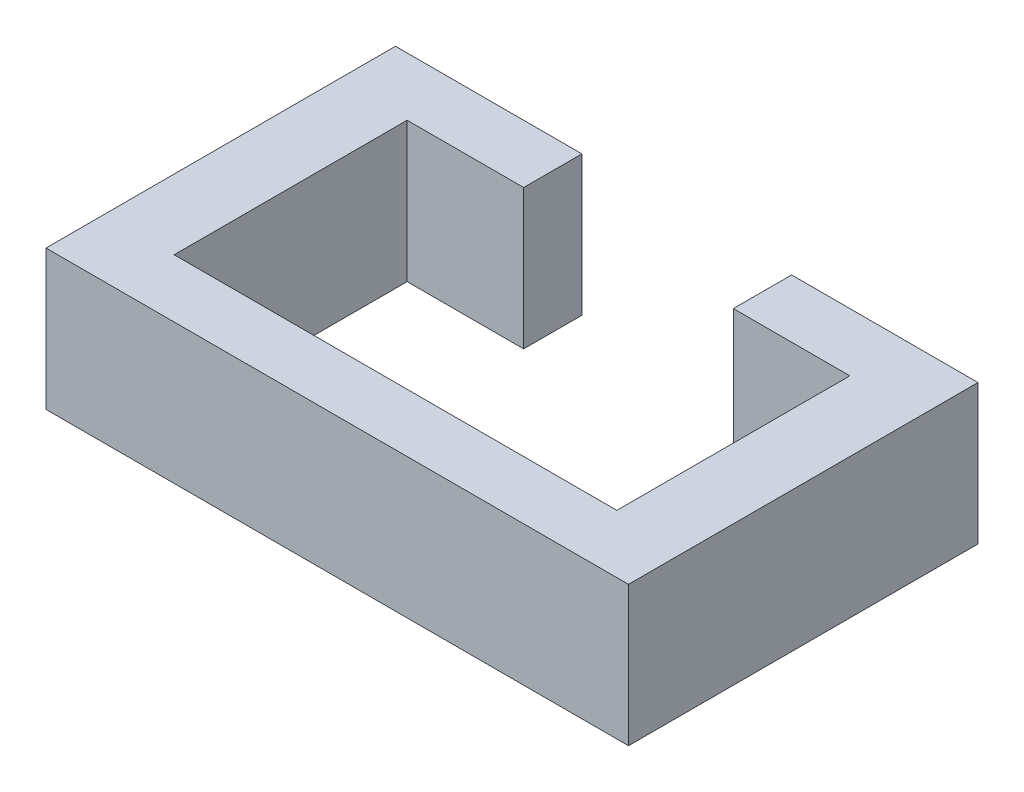
ISO-10303-21;
HEADER;
FILE_DESCRIPTION(('STEP AP214'),'2;1');
FILE_NAME('part.step','',(''),(''),'','','');
FILE_SCHEMA(('AUTOMOTIVE_DESIGN { 1 0 10303 214 1 1 1 1 }'));
ENDSEC;
DATA;
#1=APPLICATION_CONTEXT('core data for automotive mechanical design processes');
#2=APPLICATION_PROTOCOL_DEFINITION('international standard','automotive_design',2000,#1);
#3=PRODUCT_CONTEXT('',#1,'mechanical');
#4=PRODUCT('Part','Part','',(#3));
#5=PRODUCT_RELATED_PRODUCT_CATEGORY('part','',(#4));
#6=PRODUCT_DEFINITION_FORMATION('','',#4);
#7=PRODUCT_DEFINITION_CONTEXT('part definition',#1,'design');
#8=PRODUCT_DEFINITION('design','',#6,#7);
#9=PRODUCT_DEFINITION_SHAPE('','',#8);
#10=(LENGTH_UNIT() NAMED_UNIT(*) SI_UNIT(.MILLI.,.METRE.));
#11=(NAMED_UNIT(*) PLANE_ANGLE_UNIT() SI_UNIT($,.RADIAN.));
#12=(NAMED_UNIT(*) SI_UNIT($,.STERADIAN.) SOLID_ANGLE_UNIT());
#13=UNCERTAINTY_MEASURE_WITH_UNIT(LENGTH_MEASURE(1.E-05),#10,'distance_accuracy_value','');
#14=(GEOMETRIC_REPRESENTATION_CONTEXT(3) GLOBAL_UNCERTAINTY_ASSIGNED_CONTEXT((#13)) GLOBAL_UNIT_ASSIGNED_CONTEXT((#10,
#11,#12)) REPRESENTATION_CONTEXT('',''));
#15=CARTESIAN_POINT('',(0.,0.,0.));
#16=DIRECTION('',(0.,0.,1.));
#17=DIRECTION('',(1.,0.,0.));
#18=AXIS2_PLACEMENT_3D('',#15,#16,#17);
#19=CARTESIAN_POINT('',(-19.,12.,0.));
#20=DIRECTION('',(1.,0.,0.));
#21=DIRECTION('',(0.,0.,-1.));
#22=AXIS2_PLACEMENT_3D('',#19,#20,#21);
#23=PLANE('',#22);
#24=DIRECTION('',(0.,0.,1.));
#25=VECTOR('',#24,1.);
#26=CARTESIAN_POINT('',(-19.,0.,0.));
#27=LINE('',#26,#25);
#28=CARTESIAN_POINT('',(-19.,0.,-5.));
#29=VERTEX_POINT('',#28);
#30=CARTESIAN_POINT('',(-19.,0.,15.));
#31=VERTEX_POINT('',#30);
#32=EDGE_CURVE('E155',#29,#31,#27,.T.);
#33=ORIENTED_EDGE('',*,*,#32,.F.);
#34=DIRECTION('',(0.,-1.,0.));
#35=VECTOR('',#34,1.);
#36=CARTESIAN_POINT('',(-19.,12.,-5.));
#37=LINE('',#36,#35);
#38=CARTESIAN_POINT('',(-19.,12.,-5.));
#39=VERTEX_POINT('',#38);
#40=EDGE_CURVE('E11',#39,#29,#37,.T.);
#41=ORIENTED_EDGE('',*,*,#40,.F.);
#42=DIRECTION('',(0.,0.,1.));
#43=VECTOR('',#42,1.);
#44=CARTESIAN_POINT('',(-19.,12.,0.));
#45=LINE('',#44,#43);
#46=CARTESIAN_POINT('',(-19.,12.,15.));
#47=VERTEX_POINT('',#46);
#48=EDGE_CURVE('E187',#39,#47,#45,.T.);
#49=ORIENTED_EDGE('',*,*,#48,.T.);
#50=DIRECTION('',(0.,-1.,0.));
#51=VECTOR('',#50,1.);
#52=CARTESIAN_POINT('',(-19.,12.,15.));
#53=LINE('',#52,#51);
#54=EDGE_CURVE('E54',#47,#31,#53,.T.);
#55=ORIENTED_EDGE('',*,*,#54,.T.);
#56=EDGE_LOOP('',(#33,#41,#49,#55));
#57=FACE_BOUND('',#56,.T.);
#58=ADVANCED_FACE('F38',(#57),#23,.T.);
#59=CARTESIAN_POINT('',(0.,12.,-5.));
#60=DIRECTION('',(0.,0.,1.));
#61=DIRECTION('',(1.,0.,0.));
#62=AXIS2_PLACEMENT_3D('',#59,#60,#61);
#63=PLANE('',#62);
#64=DIRECTION('',(-1.,0.,0.));
#65=VECTOR('',#64,1.);
#66=CARTESIAN_POINT('',(0.,0.,-5.));
#67=LINE('',#66,#65);
#68=CARTESIAN_POINT('',(-9.,0.,-5.));
#69=VERTEX_POINT('',#68);
#70=EDGE_CURVE('E157',#69,#29,#67,.T.);
#71=ORIENTED_EDGE('',*,*,#70,.F.);
#72=DIRECTION('',(0.,-1.,0.));
#73=VECTOR('',#72,1.);
#74=CARTESIAN_POINT('',(-9.,12.,-5.));
#75=LINE('',#74,#73);
#76=CARTESIAN_POINT('',(-9.,12.,-5.));
#77=VERTEX_POINT('',#76);
#78=EDGE_CURVE('E46',#77,#69,#75,.T.);
#79=ORIENTED_EDGE('',*,*,#78,.F.);
#80=DIRECTION('',(-1.,0.,0.));
#81=VECTOR('',#80,1.);
#82=CARTESIAN_POINT('',(0.,12.,-5.));
#83=LINE('',#82,#81);
#84=EDGE_CURVE('E223',#77,#39,#83,.T.);
#85=ORIENTED_EDGE('',*,*,#84,.T.);
#86=ORIENTED_EDGE('',*,*,#40,.T.);
#87=EDGE_LOOP('',(#71,#79,#85,#86));
#88=FACE_BOUND('',#87,.T.);
#89=ADVANCED_FACE('F212',(#88),#63,.T.);
#90=CARTESIAN_POINT('',(-9.,12.,0.));
#91=DIRECTION('',(1.,0.,0.));
#92=DIRECTION('',(0.,0.,-1.));
#93=AXIS2_PLACEMENT_3D('',#90,#91,#92);
#94=PLANE('',#93);
#95=DIRECTION('',(0.,0.,1.));
#96=VECTOR('',#95,1.);
#97=CARTESIAN_POINT('',(-9.,0.,0.));
#98=LINE('',#97,#96);
#99=CARTESIAN_POINT('',(-9.,0.,-10.));
#100=VERTEX_POINT('',#99);
#101=EDGE_CURVE('E160',#100,#69,#98,.T.);
#102=ORIENTED_EDGE('',*,*,#101,.F.);
#103=DIRECTION('',(0.,-1.,0.));
#104=VECTOR('',#103,1.);
#105=CARTESIAN_POINT('',(-9.,12.,-10.));
#106=LINE('',#105,#104);
#107=CARTESIAN_POINT('',(-9.,12.,-10.));
#108=VERTEX_POINT('',#107);
#109=EDGE_CURVE('E201',#108,#100,#106,.T.);
#110=ORIENTED_EDGE('',*,*,#109,.F.);
#111=DIRECTION('',(0.,0.,1.));
#112=VECTOR('',#111,1.);
#113=CARTESIAN_POINT('',(-9.,12.,0.));
#114=LINE('',#113,#112);
#115=EDGE_CURVE('E208',#108,#77,#114,.T.);
#116=ORIENTED_EDGE('',*,*,#115,.T.);
#117=ORIENTED_EDGE('',*,*,#78,.T.);
#118=EDGE_LOOP('',(#102,#110,#116,#117));
#119=FACE_BOUND('',#118,.T.);
#120=ADVANCED_FACE('F206',(#119),#94,.T.);
#121=CARTESIAN_POINT('',(0.,12.,-10.));
#122=DIRECTION('',(0.,0.,-1.));
#123=DIRECTION('',(-1.,0.,0.));
#124=AXIS2_PLACEMENT_3D('',#121,#122,#123);
#125=PLANE('',#124);
#126=DIRECTION('',(1.,0.,0.));
#127=VECTOR('',#126,1.);
#128=CARTESIAN_POINT('',(0.,0.,-10.));
#129=LINE('',#128,#127);
#130=CARTESIAN_POINT('',(-25.,0.,-10.));
#131=VERTEX_POINT('',#130);
#132=EDGE_CURVE('E163',#131,#100,#129,.T.);
#133=ORIENTED_EDGE('',*,*,#132,.F.);
#134=DIRECTION('',(0.,-1.,0.));
#135=VECTOR('',#134,1.);
#136=CARTESIAN_POINT('',(-25.,12.,-10.));
#137=LINE('',#136,#135);
#138=CARTESIAN_POINT('',(-25.,12.,-10.));
#139=VERTEX_POINT('',#138);
#140=EDGE_CURVE('E199',#139,#131,#137,.T.);
#141=ORIENTED_EDGE('',*,*,#140,.F.);
#142=DIRECTION('',(1.,0.,0.));
#143=VECTOR('',#142,1.);
#144=CARTESIAN_POINT('',(0.,12.,-10.));
#145=LINE('',#144,#143);
#146=EDGE_CURVE('E222',#139,#108,#145,.T.);
#147=ORIENTED_EDGE('',*,*,#146,.T.);
#148=ORIENTED_EDGE('',*,*,#109,.T.);
#149=EDGE_LOOP('',(#133,#141,#147,#148));
#150=FACE_BOUND('',#149,.T.);
#151=ADVANCED_FACE('F218',(#150),#125,.T.);
#152=CARTESIAN_POINT('',(-25.,12.,0.));
#153=DIRECTION('',(1.,0.,0.));
#154=DIRECTION('',(0.,0.,-1.));
#155=AXIS2_PLACEMENT_3D('',#152,#153,#154);
#156=PLANE('',#155);
#157=DIRECTION('',(0.,0.,1.));
#158=VECTOR('',#157,1.);
#159=CARTESIAN_POINT('',(-25.,0.,0.));
#160=LINE('',#159,#158);
#161=CARTESIAN_POINT('',(-25.,0.,20.));
#162=VERTEX_POINT('',#161);
#163=EDGE_CURVE('E166',#131,#162,#160,.T.);
#164=ORIENTED_EDGE('',*,*,#163,.T.);
#165=DIRECTION('',(0.,-1.,0.));
#166=VECTOR('',#165,1.);
#167=CARTESIAN_POINT('',(-25.,12.,20.));
#168=LINE('',#167,#166);
#169=CARTESIAN_POINT('',(-25.,12.,20.));
#170=VERTEX_POINT('',#169);
#171=EDGE_CURVE('E197',#170,#162,#168,.T.);
#172=ORIENTED_EDGE('',*,*,#171,.F.);
#173=DIRECTION('',(0.,0.,1.));
#174=VECTOR('',#173,1.);
#175=CARTESIAN_POINT('',(-25.,12.,0.));
#176=LINE('',#175,#174);
#177=EDGE_CURVE('E225',#139,#170,#176,.T.);
#178=ORIENTED_EDGE('',*,*,#177,.F.);
#179=ORIENTED_EDGE('',*,*,#140,.T.);
#180=EDGE_LOOP('',(#164,#172,#178,#179));
#181=FACE_BOUND('',#180,.T.);
#182=ADVANCED_FACE('F264',(#181),#156,.F.);
#183=CARTESIAN_POINT('',(0.,12.,20.));
#184=DIRECTION('',(0.,0.,1.));
#185=DIRECTION('',(1.,0.,0.));
#186=AXIS2_PLACEMENT_3D('',#183,#184,#185);
#187=PLANE('',#186);
#188=DIRECTION('',(-1.,0.,0.));
#189=VECTOR('',#188,1.);
#190=CARTESIAN_POINT('',(0.,0.,20.));
#191=LINE('',#190,#189);
#192=CARTESIAN_POINT('',(25.,0.,20.));
#193=VERTEX_POINT('',#192);
#194=EDGE_CURVE('E169',#193,#162,#191,.T.);
#195=ORIENTED_EDGE('',*,*,#194,.F.);
#196=DIRECTION('',(0.,-1.,0.));
#197=VECTOR('',#196,1.);
#198=CARTESIAN_POINT('',(25.,12.,20.));
#199=LINE('',#198,#197);
#200=CARTESIAN_POINT('',(25.,12.,20.));
#201=VERTEX_POINT('',#200);
#202=EDGE_CURVE('E195',#201,#193,#199,.T.);
#203=ORIENTED_EDGE('',*,*,#202,.F.);
#204=DIRECTION('',(-1.,0.,0.));
#205=VECTOR('',#204,1.);
#206=CARTESIAN_POINT('',(0.,12.,20.));
#207=LINE('',#206,#205);
#208=EDGE_CURVE('E231',#201,#170,#207,.T.);
#209=ORIENTED_EDGE('',*,*,#208,.T.);
#210=ORIENTED_EDGE('',*,*,#171,.T.);
#211=EDGE_LOOP('',(#195,#203,#209,#210));
#212=FACE_BOUND('',#211,.T.);
#213=ADVANCED_FACE('F267',(#212),#187,.T.);
#214=CARTESIAN_POINT('',(25.,12.,0.));
#215=DIRECTION('',(1.,0.,0.));
#216=DIRECTION('',(0.,0.,-1.));
#217=AXIS2_PLACEMENT_3D('',#214,#215,#216);
#218=PLANE('',#217);
#219=DIRECTION('',(0.,0.,1.));
#220=VECTOR('',#219,1.);
#221=CARTESIAN_POINT('',(25.,0.,0.));
#222=LINE('',#221,#220);
#223=CARTESIAN_POINT('',(25.,0.,-10.));
#224=VERTEX_POINT('',#223);
#225=EDGE_CURVE('E172',#224,#193,#222,.T.);
#226=ORIENTED_EDGE('',*,*,#225,.F.);
#227=DIRECTION('',(0.,-1.,0.));
#228=VECTOR('',#227,1.);
#229=CARTESIAN_POINT('',(25.,12.,-10.));
#230=LINE('',#229,#228);
#231=CARTESIAN_POINT('',(25.,12.,-10.));
#232=VERTEX_POINT('',#231);
#233=EDGE_CURVE('E193',#232,#224,#230,.T.);
#234=ORIENTED_EDGE('',*,*,#233,.F.);
#235=DIRECTION('',(0.,0.,1.));
#236=VECTOR('',#235,1.);
#237=CARTESIAN_POINT('',(25.,12.,0.));
#238=LINE('',#237,#236);
#239=EDGE_CURVE('E234',#232,#201,#238,.T.);
#240=ORIENTED_EDGE('',*,*,#239,.T.);
#241=ORIENTED_EDGE('',*,*,#202,.T.);
#242=EDGE_LOOP('',(#226,#234,#240,#241));
#243=FACE_BOUND('',#242,.T.);
#244=ADVANCED_FACE('F271',(#243),#218,.T.);
#245=CARTESIAN_POINT('',(0.,12.,-10.));
#246=DIRECTION('',(0.,0.,-1.));
#247=DIRECTION('',(-1.,0.,0.));
#248=AXIS2_PLACEMENT_3D('',#245,#246,#247);
#249=PLANE('',#248);
#250=DIRECTION('',(1.,0.,0.));
#251=VECTOR('',#250,1.);
#252=CARTESIAN_POINT('',(0.,0.,-10.));
#253=LINE('',#252,#251);
#254=CARTESIAN_POINT('',(9.,0.,-10.));
#255=VERTEX_POINT('',#254);
#256=EDGE_CURVE('E175',#255,#224,#253,.T.);
#257=ORIENTED_EDGE('',*,*,#256,.F.);
#258=DIRECTION('',(0.,-1.,0.));
#259=VECTOR('',#258,1.);
#260=CARTESIAN_POINT('',(9.,12.,-10.));
#261=LINE('',#260,#259);
#262=CARTESIAN_POINT('',(9.,12.,-10.));
#263=VERTEX_POINT('',#262);
#264=EDGE_CURVE('E191',#263,#255,#261,.T.);
#265=ORIENTED_EDGE('',*,*,#264,.F.);
#266=DIRECTION('',(1.,0.,0.));
#267=VECTOR('',#266,1.);
#268=CARTESIAN_POINT('',(0.,12.,-10.));
#269=LINE('',#268,#267);
#270=EDGE_CURVE('E237',#263,#232,#269,.T.);
#271=ORIENTED_EDGE('',*,*,#270,.T.);
#272=ORIENTED_EDGE('',*,*,#233,.T.);
#273=EDGE_LOOP('',(#257,#265,#271,#272));
#274=FACE_BOUND('',#273,.T.);
#275=ADVANCED_FACE('F275',(#274),#249,.T.);
#276=CARTESIAN_POINT('',(9.,12.,0.));
#277=DIRECTION('',(-1.,0.,0.));
#278=DIRECTION('',(0.,0.,1.));
#279=AXIS2_PLACEMENT_3D('',#276,#277,#278);
#280=PLANE('',#279);
#281=DIRECTION('',(0.,0.,-1.));
#282=VECTOR('',#281,1.);
#283=CARTESIAN_POINT('',(9.,0.,0.));
#284=LINE('',#283,#282);
#285=CARTESIAN_POINT('',(9.,0.,-5.));
#286=VERTEX_POINT('',#285);
#287=EDGE_CURVE('E178',#286,#255,#284,.T.);
#288=ORIENTED_EDGE('',*,*,#287,.F.);
#289=DIRECTION('',(0.,-1.,0.));
#290=VECTOR('',#289,1.);
#291=CARTESIAN_POINT('',(9.,12.,-5.));
#292=LINE('',#291,#290);
#293=CARTESIAN_POINT('',(9.,12.,-5.));
#294=VERTEX_POINT('',#293);
#295=EDGE_CURVE('E137',#294,#286,#292,.T.);
#296=ORIENTED_EDGE('',*,*,#295,.F.);
#297=DIRECTION('',(0.,0.,-1.));
#298=VECTOR('',#297,1.);
#299=CARTESIAN_POINT('',(9.,12.,0.));
#300=LINE('',#299,#298);
#301=EDGE_CURVE('E147',#294,#263,#300,.T.);
#302=ORIENTED_EDGE('',*,*,#301,.T.);
#303=ORIENTED_EDGE('',*,*,#264,.T.);
#304=EDGE_LOOP('',(#288,#296,#302,#303));
#305=FACE_BOUND('',#304,.T.);
#306=ADVANCED_FACE('F241',(#305),#280,.T.);
#307=CARTESIAN_POINT('',(0.,12.,-5.));
#308=DIRECTION('',(0.,0.,1.));
#309=DIRECTION('',(1.,0.,0.));
#310=AXIS2_PLACEMENT_3D('',#307,#308,#309);
#311=PLANE('',#310);
#312=DIRECTION('',(-1.,0.,0.));
#313=VECTOR('',#312,1.);
#314=CARTESIAN_POINT('',(0.,0.,-5.));
#315=LINE('',#314,#313);
#316=CARTESIAN_POINT('',(19.,0.,-5.));
#317=VERTEX_POINT('',#316);
#318=EDGE_CURVE('E133',#317,#286,#315,.T.);
#319=ORIENTED_EDGE('',*,*,#318,.F.);
#320=DIRECTION('',(0.,-1.,0.));
#321=VECTOR('',#320,1.);
#322=CARTESIAN_POINT('',(19.,12.,-5.));
#323=LINE('',#322,#321);
#324=CARTESIAN_POINT('',(19.,12.,-5.));
#325=VERTEX_POINT('',#324);
#326=EDGE_CURVE('E128',#325,#317,#323,.T.);
#327=ORIENTED_EDGE('',*,*,#326,.F.);
#328=DIRECTION('',(-1.,0.,0.));
#329=VECTOR('',#328,1.);
#330=CARTESIAN_POINT('',(0.,12.,-5.));
#331=LINE('',#330,#329);
#332=EDGE_CURVE('E131',#325,#294,#331,.T.);
#333=ORIENTED_EDGE('',*,*,#332,.T.);
#334=ORIENTED_EDGE('',*,*,#295,.T.);
#335=EDGE_LOOP('',(#319,#327,#333,#334));
#336=FACE_BOUND('',#335,.T.);
#337=ADVANCED_FACE('F130',(#336),#311,.T.);
#338=CARTESIAN_POINT('',(19.,12.,0.));
#339=DIRECTION('',(-1.,0.,0.));
#340=DIRECTION('',(0.,0.,1.));
#341=AXIS2_PLACEMENT_3D('',#338,#339,#340);
#342=PLANE('',#341);
#343=DIRECTION('',(0.,0.,-1.));
#344=VECTOR('',#343,1.);
#345=CARTESIAN_POINT('',(19.,0.,0.));
#346=LINE('',#345,#344);
#347=CARTESIAN_POINT('',(19.,0.,15.));
#348=VERTEX_POINT('',#347);
#349=EDGE_CURVE('E182',#348,#317,#346,.T.);
#350=ORIENTED_EDGE('',*,*,#349,.F.);
#351=DIRECTION('',(0.,-1.,0.));
#352=VECTOR('',#351,1.);
#353=CARTESIAN_POINT('',(19.,12.,15.));
#354=LINE('',#353,#352);
#355=CARTESIAN_POINT('',(19.,12.,15.));
#356=VERTEX_POINT('',#355);
#357=EDGE_CURVE('E91',#356,#348,#354,.T.);
#358=ORIENTED_EDGE('',*,*,#357,.F.);
#359=DIRECTION('',(0.,0.,-1.));
#360=VECTOR('',#359,1.);
#361=CARTESIAN_POINT('',(19.,12.,0.));
#362=LINE('',#361,#360);
#363=EDGE_CURVE('E144',#356,#325,#362,.T.);
#364=ORIENTED_EDGE('',*,*,#363,.T.);
#365=ORIENTED_EDGE('',*,*,#326,.T.);
#366=EDGE_LOOP('',(#350,#358,#364,#365));
#367=FACE_BOUND('',#366,.T.);
#368=ADVANCED_FACE('F149',(#367),#342,.T.);
#369=CARTESIAN_POINT('',(0.,12.,15.));
#370=DIRECTION('',(0.,0.,-1.));
#371=DIRECTION('',(-1.,0.,0.));
#372=AXIS2_PLACEMENT_3D('',#369,#370,#371);
#373=PLANE('',#372);
#374=DIRECTION('',(1.,0.,0.));
#375=VECTOR('',#374,1.);
#376=CARTESIAN_POINT('',(0.,0.,15.));
#377=LINE('',#376,#375);
#378=EDGE_CURVE('E184',#31,#348,#377,.T.);
#379=ORIENTED_EDGE('',*,*,#378,.F.);
#380=ORIENTED_EDGE('',*,*,#54,.F.);
#381=DIRECTION('',(1.,0.,0.));
#382=VECTOR('',#381,1.);
#383=CARTESIAN_POINT('',(0.,12.,15.));
#384=LINE('',#383,#382);
#385=EDGE_CURVE('E150',#47,#356,#384,.T.);
#386=ORIENTED_EDGE('',*,*,#385,.T.);
#387=ORIENTED_EDGE('',*,*,#357,.T.);
#388=EDGE_LOOP('',(#379,#380,#386,#387));
#389=FACE_BOUND('',#388,.T.);
#390=ADVANCED_FACE('F243',(#389),#373,.T.);
#391=CARTESIAN_POINT('',(0.,12.,0.));
#392=DIRECTION('',(0.,1.,0.));
#393=DIRECTION('',(0.,0.,1.));
#394=AXIS2_PLACEMENT_3D('',#391,#392,#393);
#395=PLANE('',#394);
#396=ORIENTED_EDGE('',*,*,#48,.F.);
#397=ORIENTED_EDGE('',*,*,#84,.F.);
#398=ORIENTED_EDGE('',*,*,#115,.F.);
#399=ORIENTED_EDGE('',*,*,#146,.F.);
#400=ORIENTED_EDGE('',*,*,#177,.T.);
#401=ORIENTED_EDGE('',*,*,#208,.F.);
#402=ORIENTED_EDGE('',*,*,#239,.F.);
#403=ORIENTED_EDGE('',*,*,#270,.F.);
#404=ORIENTED_EDGE('',*,*,#301,.F.);
#405=ORIENTED_EDGE('',*,*,#332,.F.);
#406=ORIENTED_EDGE('',*,*,#363,.F.);
#407=ORIENTED_EDGE('',*,*,#385,.F.);
#408=EDGE_LOOP('',(#396,#397,#398,#399,#400,#401,#402,#403,#404,#405,#406,#407));
#409=FACE_BOUND('',#408,.T.);
#410=ADVANCED_FACE('F142',(#409),#395,.T.);
#411=CARTESIAN_POINT('',(0.,0.,0.));
#412=DIRECTION('',(0.,1.,0.));
#413=DIRECTION('',(0.,0.,1.));
#414=AXIS2_PLACEMENT_3D('',#411,#412,#413);
#415=PLANE('',#414);
#416=ORIENTED_EDGE('',*,*,#32,.T.);
#417=ORIENTED_EDGE('',*,*,#378,.T.);
#418=ORIENTED_EDGE('',*,*,#349,.T.);
#419=ORIENTED_EDGE('',*,*,#318,.T.);
#420=ORIENTED_EDGE('',*,*,#287,.T.);
#421=ORIENTED_EDGE('',*,*,#256,.T.);
#422=ORIENTED_EDGE('',*,*,#225,.T.);
#423=ORIENTED_EDGE('',*,*,#194,.T.);
#424=ORIENTED_EDGE('',*,*,#163,.F.);
#425=ORIENTED_EDGE('',*,*,#132,.T.);
#426=ORIENTED_EDGE('',*,*,#101,.T.);
#427=ORIENTED_EDGE('',*,*,#70,.T.);
#428=EDGE_LOOP('',(#416,#417,#418,#419,#420,#421,#422,#423,#424,#425,#426,#427));
#429=FACE_BOUND('',#428,.T.);
#430=ADVANCED_FACE('F214',(#429),#415,.F.);
#431=CLOSED_SHELL('',(#58,#89,#120,#151,#182,#213,#244,#275,#306,#337,#368,#390,#410,#430));
#432=MANIFOLD_SOLID_BREP('B2',#431);
#433=ADVANCED_BREP_SHAPE_REPRESENTATION('',(#18,#432),#14);
#434=SHAPE_DEFINITION_REPRESENTATION(#9,#433);
ENDSEC;
END-ISO-10303-21;
